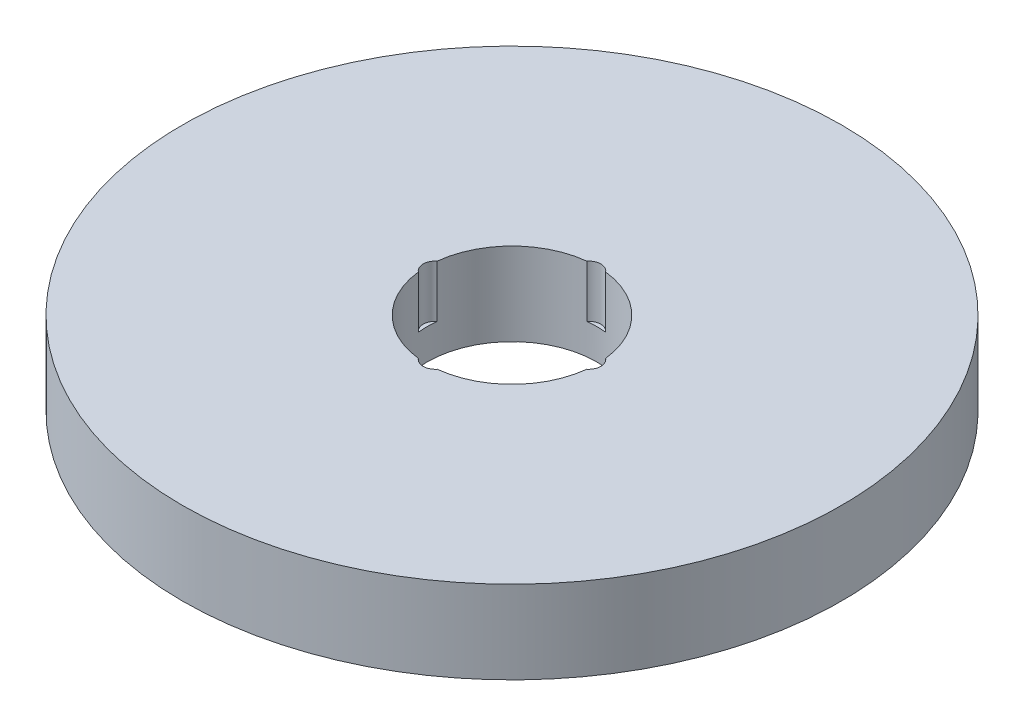
ISO-10303-21;
HEADER;
FILE_DESCRIPTION(('STEP AP214'),'2;1');
FILE_NAME('part.step','',(''),(''),'','','');
FILE_SCHEMA(('AUTOMOTIVE_DESIGN { 1 0 10303 214 1 1 1 1 }'));
ENDSEC;
DATA;
#1=APPLICATION_CONTEXT('core data for automotive mechanical design processes');
#2=APPLICATION_PROTOCOL_DEFINITION('international standard','automotive_design',2000,#1);
#3=PRODUCT_CONTEXT('',#1,'mechanical');
#4=PRODUCT('Part','Part','',(#3));
#5=PRODUCT_RELATED_PRODUCT_CATEGORY('part','',(#4));
#6=PRODUCT_DEFINITION_FORMATION('','',#4);
#7=PRODUCT_DEFINITION_CONTEXT('part definition',#1,'design');
#8=PRODUCT_DEFINITION('design','',#6,#7);
#9=PRODUCT_DEFINITION_SHAPE('','',#8);
#10=(LENGTH_UNIT() NAMED_UNIT(*) SI_UNIT(.MILLI.,.METRE.));
#11=(NAMED_UNIT(*) PLANE_ANGLE_UNIT() SI_UNIT($,.RADIAN.));
#12=(NAMED_UNIT(*) SI_UNIT($,.STERADIAN.) SOLID_ANGLE_UNIT());
#13=UNCERTAINTY_MEASURE_WITH_UNIT(LENGTH_MEASURE(1.E-05),#10,'distance_accuracy_value','');
#14=(GEOMETRIC_REPRESENTATION_CONTEXT(3) GLOBAL_UNCERTAINTY_ASSIGNED_CONTEXT((#13)) GLOBAL_UNIT_ASSIGNED_CONTEXT((#10,
#11,#12)) REPRESENTATION_CONTEXT('',''));
#15=CARTESIAN_POINT('',(0.,0.,0.));
#16=DIRECTION('',(0.,0.,1.));
#17=DIRECTION('',(1.,0.,0.));
#18=AXIS2_PLACEMENT_3D('',#15,#16,#17);
#19=CARTESIAN_POINT('',(0.,22.,0.));
#20=DIRECTION('',(0.,-1.,0.));
#21=DIRECTION('',(0.,0.,-1.));
#22=AXIS2_PLACEMENT_3D('',#19,#20,#21);
#23=CYLINDRICAL_SURFACE('',#22,87.5);
#24=CARTESIAN_POINT('',(0.,22.,0.));
#25=DIRECTION('',(0.,1.,0.));
#26=DIRECTION('',(0.,0.,1.));
#27=AXIS2_PLACEMENT_3D('',#24,#25,#26);
#28=CIRCLE('',#27,87.5);
#29=CARTESIAN_POINT('',(0.,22.,87.5));
#30=VERTEX_POINT('',#29);
#31=EDGE_CURVE('E148',#30,#30,#28,.T.);
#32=ORIENTED_EDGE('',*,*,#31,.F.);
#33=EDGE_LOOP('',(#32));
#34=FACE_BOUND('',#33,.T.);
#35=CARTESIAN_POINT('',(0.,0.,0.));
#36=DIRECTION('',(0.,1.,0.));
#37=DIRECTION('',(0.,0.,1.));
#38=AXIS2_PLACEMENT_3D('',#35,#36,#37);
#39=CIRCLE('',#38,87.5);
#40=CARTESIAN_POINT('',(0.,0.,87.5));
#41=VERTEX_POINT('',#40);
#42=EDGE_CURVE('E139',#41,#41,#39,.T.);
#43=ORIENTED_EDGE('',*,*,#42,.T.);
#44=EDGE_LOOP('',(#43));
#45=FACE_BOUND('',#44,.T.);
#46=ADVANCED_FACE('F39',(#34,#45),#23,.T.);
#47=CARTESIAN_POINT('',(0.,22.,0.));
#48=DIRECTION('',(0.,1.,0.));
#49=DIRECTION('',(0.,0.,1.));
#50=AXIS2_PLACEMENT_3D('',#47,#48,#49);
#51=PLANE('',#50);
#52=CARTESIAN_POINT('',(0.,22.,20.342853519076));
#53=DIRECTION('',(0.,1.,0.));
#54=DIRECTION('',(1.,0.,0.));
#55=AXIS2_PLACEMENT_3D('',#52,#53,#54);
#56=CIRCLE('',#55,3.22159475719856);
#57=CARTESIAN_POINT('',(-2.51251007044677,22.,22.3592775631482));
#58=VERTEX_POINT('',#57);
#59=CARTESIAN_POINT('',(2.51251007044693,22.,22.3592775631482));
#60=VERTEX_POINT('',#59);
#61=EDGE_CURVE('E175',#58,#60,#56,.T.);
#62=ORIENTED_EDGE('',*,*,#61,.F.);
#63=CARTESIAN_POINT('',(0.,22.,0.));
#64=DIRECTION('',(0.,1.,0.));
#65=DIRECTION('',(0.,0.,1.));
#66=AXIS2_PLACEMENT_3D('',#63,#64,#65);
#67=CIRCLE('',#66,22.5);
#68=CARTESIAN_POINT('',(-22.3592775631482,22.,2.51251007044685));
#69=VERTEX_POINT('',#68);
#70=EDGE_CURVE('E134',#69,#58,#67,.T.);
#71=ORIENTED_EDGE('',*,*,#70,.F.);
#72=CARTESIAN_POINT('',(-20.342853519076,22.,0.));
#73=DIRECTION('',(0.,1.,0.));
#74=DIRECTION('',(0.,0.,1.));
#75=AXIS2_PLACEMENT_3D('',#72,#73,#74);
#76=CIRCLE('',#75,3.22159475719856);
#77=CARTESIAN_POINT('',(-22.3592775631482,22.,-2.51251007044685));
#78=VERTEX_POINT('',#77);
#79=EDGE_CURVE('E143',#78,#69,#76,.T.);
#80=ORIENTED_EDGE('',*,*,#79,.F.);
#81=CARTESIAN_POINT('',(-2.51251007044709,22.,-22.3592775631482));
#82=VERTEX_POINT('',#81);
#83=EDGE_CURVE('E123',#82,#78,#67,.T.);
#84=ORIENTED_EDGE('',*,*,#83,.F.);
#85=CARTESIAN_POINT('',(-2.1308008032202E-13,22.,-20.342853519076));
#86=DIRECTION('',(0.,1.,0.));
#87=DIRECTION('',(-1.,0.,0.));
#88=AXIS2_PLACEMENT_3D('',#85,#86,#87);
#89=CIRCLE('',#88,3.22159475719856);
#90=CARTESIAN_POINT('',(2.51251007044662,22.,-22.3592775631482));
#91=VERTEX_POINT('',#90);
#92=EDGE_CURVE('E106',#91,#82,#89,.T.);
#93=ORIENTED_EDGE('',*,*,#92,.F.);
#94=CARTESIAN_POINT('',(22.3592775631482,22.,-2.51251007044685));
#95=VERTEX_POINT('',#94);
#96=EDGE_CURVE('E125',#95,#91,#67,.T.);
#97=ORIENTED_EDGE('',*,*,#96,.F.);
#98=CARTESIAN_POINT('',(20.342853519076,22.,0.));
#99=DIRECTION('',(0.,1.,0.));
#100=DIRECTION('',(0.,0.,-1.));
#101=AXIS2_PLACEMENT_3D('',#98,#99,#100);
#102=CIRCLE('',#101,3.22159475719856);
#103=CARTESIAN_POINT('',(22.3592775631482,22.,2.51251007044685));
#104=VERTEX_POINT('',#103);
#105=EDGE_CURVE('E286',#104,#95,#102,.T.);
#106=ORIENTED_EDGE('',*,*,#105,.F.);
#107=EDGE_CURVE('E135',#60,#104,#67,.T.);
#108=ORIENTED_EDGE('',*,*,#107,.F.);
#109=EDGE_LOOP('',(#62,#71,#80,#84,#93,#97,#106,#108));
#110=FACE_BOUND('',#109,.T.);
#111=ORIENTED_EDGE('',*,*,#31,.T.);
#112=EDGE_LOOP('',(#111));
#113=FACE_BOUND('',#112,.T.);
#114=ADVANCED_FACE('F118',(#110,#113),#51,.T.);
#115=CARTESIAN_POINT('',(0.,0.,0.));
#116=DIRECTION('',(0.,1.,0.));
#117=DIRECTION('',(0.,0.,1.));
#118=AXIS2_PLACEMENT_3D('',#115,#116,#117);
#119=PLANE('',#118);
#120=CARTESIAN_POINT('',(0.,0.,0.));
#121=DIRECTION('',(0.,1.,0.));
#122=DIRECTION('',(0.,0.,1.));
#123=AXIS2_PLACEMENT_3D('',#120,#121,#122);
#124=CIRCLE('',#123,22.5);
#125=CARTESIAN_POINT('',(0.,0.,22.5));
#126=VERTEX_POINT('',#125);
#127=EDGE_CURVE('E136',#126,#126,#124,.T.);
#128=ORIENTED_EDGE('',*,*,#127,.T.);
#129=EDGE_LOOP('',(#128));
#130=FACE_BOUND('',#129,.T.);
#131=ORIENTED_EDGE('',*,*,#42,.F.);
#132=EDGE_LOOP('',(#131));
#133=FACE_BOUND('',#132,.T.);
#134=ADVANCED_FACE('F187',(#130,#133),#119,.F.);
#135=CARTESIAN_POINT('',(0.,22.,0.));
#136=DIRECTION('',(0.,-1.,0.));
#137=DIRECTION('',(0.,0.,-1.));
#138=AXIS2_PLACEMENT_3D('',#135,#136,#137);
#139=CYLINDRICAL_SURFACE('',#138,22.5);
#140=DIRECTION('',(0.,1.,0.));
#141=VECTOR('',#140,1.);
#142=CARTESIAN_POINT('',(-2.51251007044676,15.0692927059901,22.3592775631482));
#143=LINE('',#142,#141);
#144=CARTESIAN_POINT('',(-2.51251007044677,8.13858541198024,22.3592775631482));
#145=VERTEX_POINT('',#144);
#146=EDGE_CURVE('E11',#145,#58,#143,.T.);
#147=ORIENTED_EDGE('',*,*,#146,.F.);
#148=CARTESIAN_POINT('',(0.,8.13858541198024,0.));
#149=DIRECTION('',(0.,1.,0.));
#150=DIRECTION('',(0.,0.,1.));
#151=AXIS2_PLACEMENT_3D('',#148,#149,#150);
#152=CIRCLE('',#151,22.5);
#153=CARTESIAN_POINT('',(2.51251007044693,8.13858541198024,22.3592775631482));
#154=VERTEX_POINT('',#153);
#155=EDGE_CURVE('E170',#145,#154,#152,.T.);
#156=ORIENTED_EDGE('',*,*,#155,.T.);
#157=DIRECTION('',(0.,1.,0.));
#158=VECTOR('',#157,1.);
#159=CARTESIAN_POINT('',(2.51251007044692,15.0692927059901,22.3592775631482));
#160=LINE('',#159,#158);
#161=EDGE_CURVE('E46',#60,#154,#160,.F.);
#162=ORIENTED_EDGE('',*,*,#161,.F.);
#163=ORIENTED_EDGE('',*,*,#107,.T.);
#164=DIRECTION('',(0.,1.,0.));
#165=VECTOR('',#164,1.);
#166=CARTESIAN_POINT('',(22.3592775631482,15.0692927059901,2.51251007044684));
#167=LINE('',#166,#165);
#168=CARTESIAN_POINT('',(22.3592775631482,8.13858541198024,2.51251007044685));
#169=VERTEX_POINT('',#168);
#170=EDGE_CURVE('E164',#169,#104,#167,.T.);
#171=ORIENTED_EDGE('',*,*,#170,.F.);
#172=CARTESIAN_POINT('',(0.,8.13858541198024,0.));
#173=DIRECTION('',(0.,1.,0.));
#174=DIRECTION('',(0.,0.,1.));
#175=AXIS2_PLACEMENT_3D('',#172,#173,#174);
#176=CIRCLE('',#175,22.5);
#177=CARTESIAN_POINT('',(22.3592775631482,8.13858541198024,-2.51251007044685));
#178=VERTEX_POINT('',#177);
#179=EDGE_CURVE('E115',#169,#178,#176,.T.);
#180=ORIENTED_EDGE('',*,*,#179,.T.);
#181=DIRECTION('',(0.,1.,0.));
#182=VECTOR('',#181,1.);
#183=CARTESIAN_POINT('',(22.3592775631482,15.0692927059901,-2.51251007044684));
#184=LINE('',#183,#182);
#185=EDGE_CURVE('E131',#95,#178,#184,.F.);
#186=ORIENTED_EDGE('',*,*,#185,.F.);
#187=ORIENTED_EDGE('',*,*,#96,.T.);
#188=DIRECTION('',(0.,1.,0.));
#189=VECTOR('',#188,1.);
#190=CARTESIAN_POINT('',(2.51251007044661,15.0692927059901,-22.3592775631483));
#191=LINE('',#190,#189);
#192=CARTESIAN_POINT('',(2.51251007044662,8.13858541198024,-22.3592775631482));
#193=VERTEX_POINT('',#192);
#194=EDGE_CURVE('E105',#193,#91,#191,.T.);
#195=ORIENTED_EDGE('',*,*,#194,.F.);
#196=CARTESIAN_POINT('',(0.,8.13858541198024,0.));
#197=DIRECTION('',(0.,1.,0.));
#198=DIRECTION('',(0.,0.,1.));
#199=AXIS2_PLACEMENT_3D('',#196,#197,#198);
#200=CIRCLE('',#199,22.5);
#201=CARTESIAN_POINT('',(-2.51251007044709,8.13858541198024,-22.3592775631482));
#202=VERTEX_POINT('',#201);
#203=EDGE_CURVE('E159',#193,#202,#200,.T.);
#204=ORIENTED_EDGE('',*,*,#203,.T.);
#205=DIRECTION('',(0.,1.,0.));
#206=VECTOR('',#205,1.);
#207=CARTESIAN_POINT('',(-2.51251007044708,15.0692927059901,-22.3592775631482));
#208=LINE('',#207,#206);
#209=EDGE_CURVE('E114',#82,#202,#208,.F.);
#210=ORIENTED_EDGE('',*,*,#209,.F.);
#211=ORIENTED_EDGE('',*,*,#83,.T.);
#212=DIRECTION('',(0.,1.,0.));
#213=VECTOR('',#212,1.);
#214=CARTESIAN_POINT('',(-22.3592775631482,15.0692927059901,-2.51251007044684));
#215=LINE('',#214,#213);
#216=CARTESIAN_POINT('',(-22.3592775631482,8.13858541198024,-2.51251007044685));
#217=VERTEX_POINT('',#216);
#218=EDGE_CURVE('E160',#217,#78,#215,.T.);
#219=ORIENTED_EDGE('',*,*,#218,.F.);
#220=CARTESIAN_POINT('',(0.,8.13858541198024,0.));
#221=DIRECTION('',(0.,1.,0.));
#222=DIRECTION('',(0.,0.,1.));
#223=AXIS2_PLACEMENT_3D('',#220,#221,#222);
#224=CIRCLE('',#223,22.5);
#225=CARTESIAN_POINT('',(-22.3592775631482,8.13858541198024,2.51251007044685));
#226=VERTEX_POINT('',#225);
#227=EDGE_CURVE('E149',#217,#226,#224,.T.);
#228=ORIENTED_EDGE('',*,*,#227,.T.);
#229=DIRECTION('',(0.,1.,0.));
#230=VECTOR('',#229,1.);
#231=CARTESIAN_POINT('',(-22.3592775631482,15.0692927059901,2.51251007044684));
#232=LINE('',#231,#230);
#233=EDGE_CURVE('E152',#69,#226,#232,.F.);
#234=ORIENTED_EDGE('',*,*,#233,.F.);
#235=ORIENTED_EDGE('',*,*,#70,.T.);
#236=EDGE_LOOP('',(#147,#156,#162,#163,#171,#180,#186,#187,#195,#204,#210,#211,#219,#228,#234,#235));
#237=FACE_BOUND('',#236,.T.);
#238=ORIENTED_EDGE('',*,*,#127,.F.);
#239=EDGE_LOOP('',(#238));
#240=FACE_BOUND('',#239,.T.);
#241=ADVANCED_FACE('F126',(#237,#240),#139,.F.);
#242=CARTESIAN_POINT('',(-20.342853519076,8.13858541198024,0.));
#243=DIRECTION('',(0.,1.,0.));
#244=DIRECTION('',(0.,0.,1.));
#245=AXIS2_PLACEMENT_3D('',#242,#243,#244);
#246=CYLINDRICAL_SURFACE('',#245,3.22159475719856);
#247=ORIENTED_EDGE('',*,*,#218,.T.);
#248=ORIENTED_EDGE('',*,*,#79,.T.);
#249=ORIENTED_EDGE('',*,*,#233,.T.);
#250=CARTESIAN_POINT('',(-20.342853519076,8.13858541198024,0.));
#251=DIRECTION('',(0.,1.,0.));
#252=DIRECTION('',(0.,0.,1.));
#253=AXIS2_PLACEMENT_3D('',#250,#251,#252);
#254=CIRCLE('',#253,3.22159475719856);
#255=EDGE_CURVE('E144',#217,#226,#254,.T.);
#256=ORIENTED_EDGE('',*,*,#255,.F.);
#257=EDGE_LOOP('',(#247,#248,#249,#256));
#258=FACE_BOUND('',#257,.T.);
#259=ADVANCED_FACE('F200',(#258),#246,.F.);
#260=CARTESIAN_POINT('',(-20.342853519076,8.13858541198024,0.));
#261=DIRECTION('',(0.,1.,0.));
#262=DIRECTION('',(0.,0.,1.));
#263=AXIS2_PLACEMENT_3D('',#260,#261,#262);
#264=PLANE('',#263);
#265=ORIENTED_EDGE('',*,*,#255,.T.);
#266=ORIENTED_EDGE('',*,*,#227,.F.);
#267=EDGE_LOOP('',(#265,#266));
#268=FACE_BOUND('',#267,.T.);
#269=ADVANCED_FACE('F201',(#268),#264,.T.);
#270=CARTESIAN_POINT('',(-2.1308008032202E-13,8.13858541198024,-20.342853519076));
#271=DIRECTION('',(0.,1.,0.));
#272=DIRECTION('',(0.,0.,1.));
#273=AXIS2_PLACEMENT_3D('',#270,#271,#272);
#274=CYLINDRICAL_SURFACE('',#273,3.22159475719856);
#275=ORIENTED_EDGE('',*,*,#194,.T.);
#276=ORIENTED_EDGE('',*,*,#92,.T.);
#277=ORIENTED_EDGE('',*,*,#209,.T.);
#278=CARTESIAN_POINT('',(-2.1308008032202E-13,8.13858541198024,-20.342853519076));
#279=DIRECTION('',(0.,1.,0.));
#280=DIRECTION('',(-1.,0.,0.));
#281=AXIS2_PLACEMENT_3D('',#278,#279,#280);
#282=CIRCLE('',#281,3.22159475719856);
#283=EDGE_CURVE('E107',#193,#202,#282,.T.);
#284=ORIENTED_EDGE('',*,*,#283,.F.);
#285=EDGE_LOOP('',(#275,#276,#277,#284));
#286=FACE_BOUND('',#285,.T.);
#287=ADVANCED_FACE('F102',(#286),#274,.F.);
#288=CARTESIAN_POINT('',(-2.1308008032202E-13,8.13858541198024,-20.342853519076));
#289=DIRECTION('',(0.,1.,0.));
#290=DIRECTION('',(-1.,0.,0.));
#291=AXIS2_PLACEMENT_3D('',#288,#289,#290);
#292=PLANE('',#291);
#293=ORIENTED_EDGE('',*,*,#283,.T.);
#294=ORIENTED_EDGE('',*,*,#203,.F.);
#295=EDGE_LOOP('',(#293,#294));
#296=FACE_BOUND('',#295,.T.);
#297=ADVANCED_FACE('F209',(#296),#292,.T.);
#298=CARTESIAN_POINT('',(20.342853519076,8.13858541198024,0.));
#299=DIRECTION('',(0.,1.,0.));
#300=DIRECTION('',(0.,0.,1.));
#301=AXIS2_PLACEMENT_3D('',#298,#299,#300);
#302=CYLINDRICAL_SURFACE('',#301,3.22159475719856);
#303=ORIENTED_EDGE('',*,*,#170,.T.);
#304=ORIENTED_EDGE('',*,*,#105,.T.);
#305=ORIENTED_EDGE('',*,*,#185,.T.);
#306=CARTESIAN_POINT('',(20.342853519076,8.13858541198024,0.));
#307=DIRECTION('',(0.,1.,0.));
#308=DIRECTION('',(0.,0.,-1.));
#309=AXIS2_PLACEMENT_3D('',#306,#307,#308);
#310=CIRCLE('',#309,3.22159475719856);
#311=EDGE_CURVE('E56',#169,#178,#310,.T.);
#312=ORIENTED_EDGE('',*,*,#311,.F.);
#313=EDGE_LOOP('',(#303,#304,#305,#312));
#314=FACE_BOUND('',#313,.T.);
#315=ADVANCED_FACE('F213',(#314),#302,.F.);
#316=CARTESIAN_POINT('',(20.342853519076,8.13858541198024,0.));
#317=DIRECTION('',(0.,1.,0.));
#318=DIRECTION('',(0.,0.,-1.));
#319=AXIS2_PLACEMENT_3D('',#316,#317,#318);
#320=PLANE('',#319);
#321=ORIENTED_EDGE('',*,*,#311,.T.);
#322=ORIENTED_EDGE('',*,*,#179,.F.);
#323=EDGE_LOOP('',(#321,#322));
#324=FACE_BOUND('',#323,.T.);
#325=ADVANCED_FACE('F179',(#324),#320,.T.);
#326=CARTESIAN_POINT('',(0.,8.13858541198024,20.342853519076));
#327=DIRECTION('',(0.,1.,0.));
#328=DIRECTION('',(0.,0.,1.));
#329=AXIS2_PLACEMENT_3D('',#326,#327,#328);
#330=CYLINDRICAL_SURFACE('',#329,3.22159475719856);
#331=ORIENTED_EDGE('',*,*,#146,.T.);
#332=ORIENTED_EDGE('',*,*,#61,.T.);
#333=ORIENTED_EDGE('',*,*,#161,.T.);
#334=CARTESIAN_POINT('',(0.,8.13858541198024,20.342853519076));
#335=DIRECTION('',(0.,1.,0.));
#336=DIRECTION('',(1.,0.,0.));
#337=AXIS2_PLACEMENT_3D('',#334,#335,#336);
#338=CIRCLE('',#337,3.22159475719856);
#339=EDGE_CURVE('E55',#145,#154,#338,.T.);
#340=ORIENTED_EDGE('',*,*,#339,.F.);
#341=EDGE_LOOP('',(#331,#332,#333,#340));
#342=FACE_BOUND('',#341,.T.);
#343=ADVANCED_FACE('F171',(#342),#330,.F.);
#344=CARTESIAN_POINT('',(0.,8.13858541198024,20.342853519076));
#345=DIRECTION('',(0.,1.,0.));
#346=DIRECTION('',(1.,0.,0.));
#347=AXIS2_PLACEMENT_3D('',#344,#345,#346);
#348=PLANE('',#347);
#349=ORIENTED_EDGE('',*,*,#339,.T.);
#350=ORIENTED_EDGE('',*,*,#155,.F.);
#351=EDGE_LOOP('',(#349,#350));
#352=FACE_BOUND('',#351,.T.);
#353=ADVANCED_FACE('F173',(#352),#348,.T.);
#354=CLOSED_SHELL('',(#46,#114,#134,#241,#259,#269,#287,#297,#315,#325,#343,#353));
#355=MANIFOLD_SOLID_BREP('B2',#354);
#356=ADVANCED_BREP_SHAPE_REPRESENTATION('',(#18,#355),#14);
#357=SHAPE_DEFINITION_REPRESENTATION(#9,#356);
ENDSEC;
END-ISO-10303-21;
